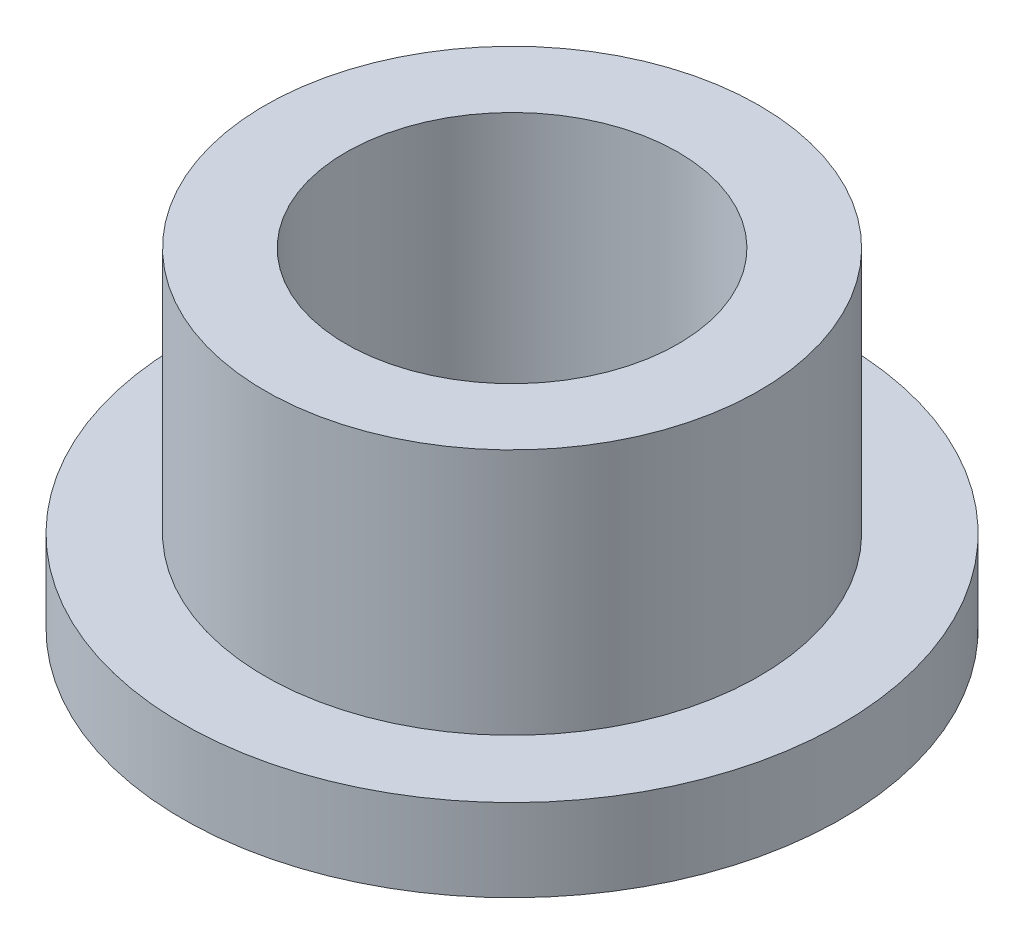
ISO-10303-21;
HEADER;
FILE_DESCRIPTION(('STEP AP214'),'2;1');
FILE_NAME('part.step','',(''),(''),'','','');
FILE_SCHEMA(('AUTOMOTIVE_DESIGN { 1 0 10303 214 1 1 1 1 }'));
ENDSEC;
DATA;
#1=APPLICATION_CONTEXT('core data for automotive mechanical design processes');
#2=APPLICATION_PROTOCOL_DEFINITION('international standard','automotive_design',2000,#1);
#3=PRODUCT_CONTEXT('',#1,'mechanical');
#4=PRODUCT('Part','Part','',(#3));
#5=PRODUCT_RELATED_PRODUCT_CATEGORY('part','',(#4));
#6=PRODUCT_DEFINITION_FORMATION('','',#4);
#7=PRODUCT_DEFINITION_CONTEXT('part definition',#1,'design');
#8=PRODUCT_DEFINITION('design','',#6,#7);
#9=PRODUCT_DEFINITION_SHAPE('','',#8);
#10=(LENGTH_UNIT() NAMED_UNIT(*) SI_UNIT(.MILLI.,.METRE.));
#11=(NAMED_UNIT(*) PLANE_ANGLE_UNIT() SI_UNIT($,.RADIAN.));
#12=(NAMED_UNIT(*) SI_UNIT($,.STERADIAN.) SOLID_ANGLE_UNIT());
#13=UNCERTAINTY_MEASURE_WITH_UNIT(LENGTH_MEASURE(1.E-05),#10,'distance_accuracy_value','');
#14=(GEOMETRIC_REPRESENTATION_CONTEXT(3) GLOBAL_UNCERTAINTY_ASSIGNED_CONTEXT((#13)) GLOBAL_UNIT_ASSIGNED_CONTEXT((#10,
#11,#12)) REPRESENTATION_CONTEXT('',''));
#15=CARTESIAN_POINT('',(0.,0.,0.));
#16=DIRECTION('',(0.,0.,1.));
#17=DIRECTION('',(1.,0.,0.));
#18=AXIS2_PLACEMENT_3D('',#15,#16,#17);
#19=CARTESIAN_POINT('',(0.,0.,0.));
#20=DIRECTION('',(0.,1.,0.));
#21=DIRECTION('',(0.,0.,1.));
#22=AXIS2_PLACEMENT_3D('',#19,#20,#21);
#23=PLANE('',#22);
#24=CARTESIAN_POINT('',(0.,0.,0.));
#25=DIRECTION('',(0.,-1.,0.));
#26=DIRECTION('',(0.,0.,-1.));
#27=AXIS2_PLACEMENT_3D('',#24,#25,#26);
#28=CIRCLE('',#27,3.2004);
#29=CARTESIAN_POINT('',(0.,0.,-3.2004));
#30=VERTEX_POINT('',#29);
#31=EDGE_CURVE('E33',#30,#30,#28,.F.);
#32=ORIENTED_EDGE('',*,*,#31,.T.);
#33=EDGE_LOOP('',(#32));
#34=FACE_BOUND('',#33,.T.);
#35=CARTESIAN_POINT('',(0.,0.,0.));
#36=DIRECTION('',(0.,-1.,0.));
#37=DIRECTION('',(0.,0.,-1.));
#38=AXIS2_PLACEMENT_3D('',#35,#36,#37);
#39=CIRCLE('',#38,6.35);
#40=CARTESIAN_POINT('',(0.,0.,-6.35));
#41=VERTEX_POINT('',#40);
#42=EDGE_CURVE('E17',#41,#41,#39,.F.);
#43=ORIENTED_EDGE('',*,*,#42,.F.);
#44=EDGE_LOOP('',(#43));
#45=FACE_BOUND('',#44,.T.);
#46=ADVANCED_FACE('F14',(#34,#45),#23,.F.);
#47=CARTESIAN_POINT('',(0.,1.5875,0.));
#48=DIRECTION('',(0.,-1.,0.));
#49=DIRECTION('',(0.,0.,-1.));
#50=AXIS2_PLACEMENT_3D('',#47,#48,#49);
#51=CYLINDRICAL_SURFACE('',#50,6.35);
#52=CARTESIAN_POINT('',(0.,1.5875,0.));
#53=DIRECTION('',(0.,-1.,0.));
#54=DIRECTION('',(0.,0.,-1.));
#55=AXIS2_PLACEMENT_3D('',#52,#53,#54);
#56=CIRCLE('',#55,6.35);
#57=CARTESIAN_POINT('',(0.,1.5875,-6.35));
#58=VERTEX_POINT('',#57);
#59=EDGE_CURVE('E31',#58,#58,#56,.F.);
#60=ORIENTED_EDGE('',*,*,#59,.F.);
#61=EDGE_LOOP('',(#60));
#62=FACE_BOUND('',#61,.T.);
#63=ORIENTED_EDGE('',*,*,#42,.T.);
#64=EDGE_LOOP('',(#63));
#65=FACE_BOUND('',#64,.T.);
#66=ADVANCED_FACE('F40',(#62,#65),#51,.T.);
#67=CARTESIAN_POINT('',(0.,6.35,0.));
#68=DIRECTION('',(0.,-1.,0.));
#69=DIRECTION('',(0.,0.,-1.));
#70=AXIS2_PLACEMENT_3D('',#67,#68,#69);
#71=CYLINDRICAL_SURFACE('',#70,3.2004);
#72=ORIENTED_EDGE('',*,*,#31,.F.);
#73=EDGE_LOOP('',(#72));
#74=FACE_BOUND('',#73,.T.);
#75=CARTESIAN_POINT('',(0.,6.35,0.));
#76=DIRECTION('',(0.,-1.,0.));
#77=DIRECTION('',(0.,0.,-1.));
#78=AXIS2_PLACEMENT_3D('',#75,#76,#77);
#79=CIRCLE('',#78,3.2004);
#80=CARTESIAN_POINT('',(0.,6.35,-3.2004));
#81=VERTEX_POINT('',#80);
#82=EDGE_CURVE('E26',#81,#81,#79,.T.);
#83=ORIENTED_EDGE('',*,*,#82,.F.);
#84=EDGE_LOOP('',(#83));
#85=FACE_BOUND('',#84,.T.);
#86=ADVANCED_FACE('F47',(#74,#85),#71,.F.);
#87=CARTESIAN_POINT('',(0.,1.5875,0.));
#88=DIRECTION('',(0.,1.,0.));
#89=DIRECTION('',(0.,0.,1.));
#90=AXIS2_PLACEMENT_3D('',#87,#88,#89);
#91=PLANE('',#90);
#92=CARTESIAN_POINT('',(0.,1.5875,0.));
#93=DIRECTION('',(0.,-1.,0.));
#94=DIRECTION('',(0.,0.,-1.));
#95=AXIS2_PLACEMENT_3D('',#92,#93,#94);
#96=CIRCLE('',#95,4.7625);
#97=CARTESIAN_POINT('',(0.,1.5875,-4.7625));
#98=VERTEX_POINT('',#97);
#99=EDGE_CURVE('E21',#98,#98,#96,.F.);
#100=ORIENTED_EDGE('',*,*,#99,.F.);
#101=EDGE_LOOP('',(#100));
#102=FACE_BOUND('',#101,.T.);
#103=ORIENTED_EDGE('',*,*,#59,.T.);
#104=EDGE_LOOP('',(#103));
#105=FACE_BOUND('',#104,.T.);
#106=ADVANCED_FACE('F56',(#102,#105),#91,.T.);
#107=CARTESIAN_POINT('',(0.,6.35,0.));
#108=DIRECTION('',(0.,1.,0.));
#109=DIRECTION('',(0.,0.,1.));
#110=AXIS2_PLACEMENT_3D('',#107,#108,#109);
#111=PLANE('',#110);
#112=ORIENTED_EDGE('',*,*,#82,.T.);
#113=EDGE_LOOP('',(#112));
#114=FACE_BOUND('',#113,.T.);
#115=CARTESIAN_POINT('',(0.,6.35,0.));
#116=DIRECTION('',(0.,-1.,0.));
#117=DIRECTION('',(0.,0.,-1.));
#118=AXIS2_PLACEMENT_3D('',#115,#116,#117);
#119=CIRCLE('',#118,4.7625);
#120=CARTESIAN_POINT('',(0.,6.35,-4.7625));
#121=VERTEX_POINT('',#120);
#122=EDGE_CURVE('E10',#121,#121,#119,.T.);
#123=ORIENTED_EDGE('',*,*,#122,.F.);
#124=EDGE_LOOP('',(#123));
#125=FACE_BOUND('',#124,.T.);
#126=ADVANCED_FACE('F51',(#114,#125),#111,.T.);
#127=CARTESIAN_POINT('',(0.,6.35,0.));
#128=DIRECTION('',(0.,-1.,0.));
#129=DIRECTION('',(0.,0.,-1.));
#130=AXIS2_PLACEMENT_3D('',#127,#128,#129);
#131=CYLINDRICAL_SURFACE('',#130,4.7625);
#132=ORIENTED_EDGE('',*,*,#122,.T.);
#133=EDGE_LOOP('',(#132));
#134=FACE_BOUND('',#133,.T.);
#135=ORIENTED_EDGE('',*,*,#99,.T.);
#136=EDGE_LOOP('',(#135));
#137=FACE_BOUND('',#136,.T.);
#138=ADVANCED_FACE('F49',(#134,#137),#131,.T.);
#139=CLOSED_SHELL('',(#46,#66,#86,#106,#126,#138));
#140=MANIFOLD_SOLID_BREP('B1',#139);
#141=ADVANCED_BREP_SHAPE_REPRESENTATION('',(#18,#140),#14);
#142=SHAPE_DEFINITION_REPRESENTATION(#9,#141);
ENDSEC;
END-ISO-10303-21;
